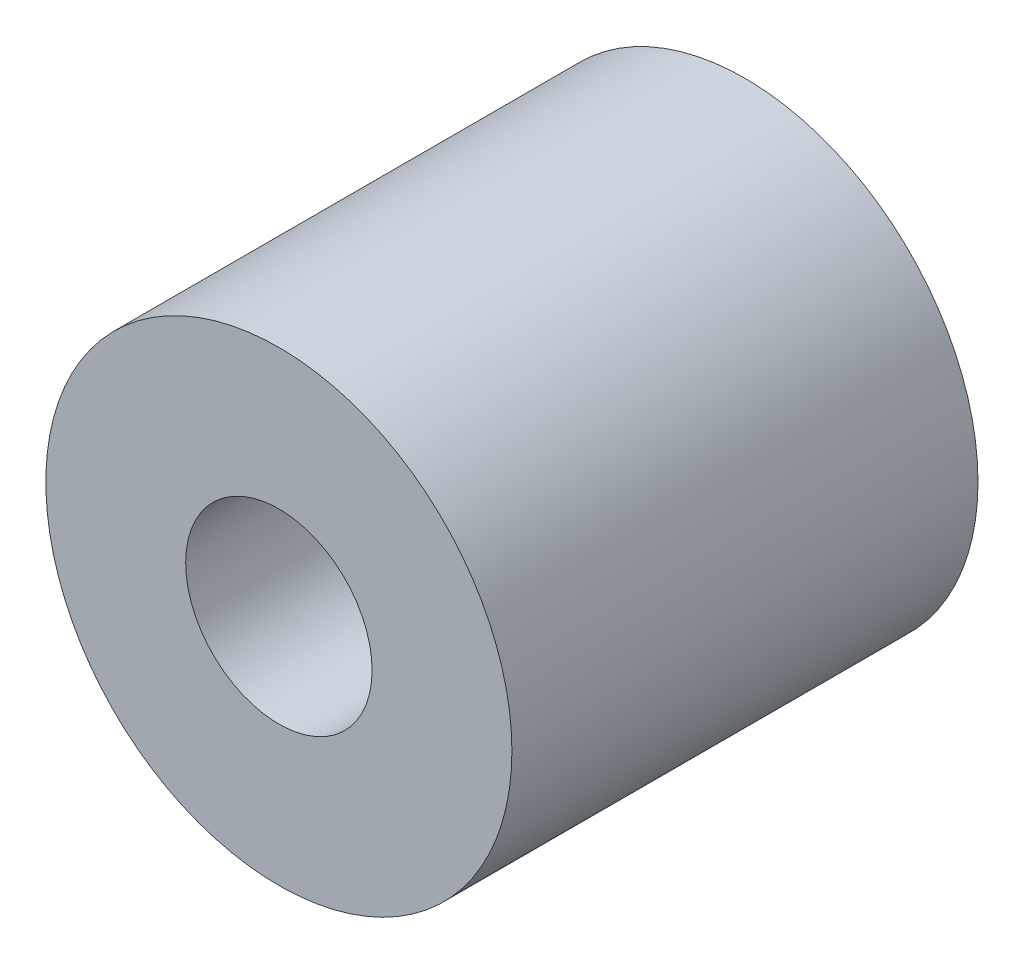
ISO-10303-21;
HEADER;
FILE_DESCRIPTION(('STEP AP214'),'2;1');
FILE_NAME('part.step','',(''),(''),'','','');
FILE_SCHEMA(('AUTOMOTIVE_DESIGN { 1 0 10303 214 1 1 1 1 }'));
ENDSEC;
DATA;
#1=APPLICATION_CONTEXT('core data for automotive mechanical design processes');
#2=APPLICATION_PROTOCOL_DEFINITION('international standard','automotive_design',2000,#1);
#3=PRODUCT_CONTEXT('',#1,'mechanical');
#4=PRODUCT('Part','Part','',(#3));
#5=PRODUCT_RELATED_PRODUCT_CATEGORY('part','',(#4));
#6=PRODUCT_DEFINITION_FORMATION('','',#4);
#7=PRODUCT_DEFINITION_CONTEXT('part definition',#1,'design');
#8=PRODUCT_DEFINITION('design','',#6,#7);
#9=PRODUCT_DEFINITION_SHAPE('','',#8);
#10=(LENGTH_UNIT() NAMED_UNIT(*) SI_UNIT(.MILLI.,.METRE.));
#11=(NAMED_UNIT(*) PLANE_ANGLE_UNIT() SI_UNIT($,.RADIAN.));
#12=(NAMED_UNIT(*) SI_UNIT($,.STERADIAN.) SOLID_ANGLE_UNIT());
#13=UNCERTAINTY_MEASURE_WITH_UNIT(LENGTH_MEASURE(1.E-05),#10,'distance_accuracy_value','');
#14=(GEOMETRIC_REPRESENTATION_CONTEXT(3) GLOBAL_UNCERTAINTY_ASSIGNED_CONTEXT((#13)) GLOBAL_UNIT_ASSIGNED_CONTEXT((#10,
#11,#12)) REPRESENTATION_CONTEXT('',''));
#15=CARTESIAN_POINT('',(0.,0.,0.));
#16=DIRECTION('',(0.,0.,1.));
#17=DIRECTION('',(1.,0.,0.));
#18=AXIS2_PLACEMENT_3D('',#15,#16,#17);
#19=CARTESIAN_POINT('',(0.,0.,25.));
#20=DIRECTION('',(0.,0.,1.));
#21=DIRECTION('',(1.,0.,0.));
#22=AXIS2_PLACEMENT_3D('',#19,#20,#21);
#23=PLANE('',#22);
#24=CARTESIAN_POINT('',(0.,0.,25.));
#25=DIRECTION('',(0.,0.,1.));
#26=DIRECTION('',(1.,0.,0.));
#27=AXIS2_PLACEMENT_3D('',#24,#25,#26);
#28=CIRCLE('',#27,12.5);
#29=CARTESIAN_POINT('',(12.5,0.,25.));
#30=VERTEX_POINT('',#29);
#31=EDGE_CURVE('E10',#30,#30,#28,.T.);
#32=ORIENTED_EDGE('',*,*,#31,.T.);
#33=EDGE_LOOP('',(#32));
#34=FACE_BOUND('',#33,.T.);
#35=CARTESIAN_POINT('',(0.,0.,25.));
#36=DIRECTION('',(0.,0.,1.));
#37=DIRECTION('',(1.,0.,0.));
#38=AXIS2_PLACEMENT_3D('',#35,#36,#37);
#39=CIRCLE('',#38,5.);
#40=CARTESIAN_POINT('',(5.,0.,25.));
#41=VERTEX_POINT('',#40);
#42=EDGE_CURVE('E50',#41,#41,#39,.T.);
#43=ORIENTED_EDGE('',*,*,#42,.F.);
#44=EDGE_LOOP('',(#43));
#45=FACE_BOUND('',#44,.T.);
#46=ADVANCED_FACE('F37',(#34,#45),#23,.T.);
#47=CARTESIAN_POINT('',(0.,0.,0.));
#48=DIRECTION('',(0.,0.,1.));
#49=DIRECTION('',(1.,0.,0.));
#50=AXIS2_PLACEMENT_3D('',#47,#48,#49);
#51=PLANE('',#50);
#52=CARTESIAN_POINT('',(0.,0.,0.));
#53=DIRECTION('',(0.,0.,1.));
#54=DIRECTION('',(1.,0.,0.));
#55=AXIS2_PLACEMENT_3D('',#52,#53,#54);
#56=CIRCLE('',#55,12.5);
#57=CARTESIAN_POINT('',(12.5,0.,0.));
#58=VERTEX_POINT('',#57);
#59=EDGE_CURVE('E41',#58,#58,#56,.T.);
#60=ORIENTED_EDGE('',*,*,#59,.F.);
#61=EDGE_LOOP('',(#60));
#62=FACE_BOUND('',#61,.T.);
#63=CARTESIAN_POINT('',(0.,0.,0.));
#64=DIRECTION('',(0.,0.,1.));
#65=DIRECTION('',(1.,0.,0.));
#66=AXIS2_PLACEMENT_3D('',#63,#64,#65);
#67=CIRCLE('',#66,5.);
#68=CARTESIAN_POINT('',(5.,0.,0.));
#69=VERTEX_POINT('',#68);
#70=EDGE_CURVE('E52',#69,#69,#67,.T.);
#71=ORIENTED_EDGE('',*,*,#70,.T.);
#72=EDGE_LOOP('',(#71));
#73=FACE_BOUND('',#72,.T.);
#74=ADVANCED_FACE('F64',(#62,#73),#51,.F.);
#75=CARTESIAN_POINT('',(0.,0.,25.));
#76=DIRECTION('',(0.,0.,-1.));
#77=DIRECTION('',(-1.,0.,0.));
#78=AXIS2_PLACEMENT_3D('',#75,#76,#77);
#79=CYLINDRICAL_SURFACE('',#78,12.5);
#80=ORIENTED_EDGE('',*,*,#31,.F.);
#81=EDGE_LOOP('',(#80));
#82=FACE_BOUND('',#81,.T.);
#83=ORIENTED_EDGE('',*,*,#59,.T.);
#84=EDGE_LOOP('',(#83));
#85=FACE_BOUND('',#84,.T.);
#86=ADVANCED_FACE('F39',(#82,#85),#79,.T.);
#87=CARTESIAN_POINT('',(0.,0.,25.));
#88=DIRECTION('',(0.,0.,-1.));
#89=DIRECTION('',(-1.,0.,0.));
#90=AXIS2_PLACEMENT_3D('',#87,#88,#89);
#91=CYLINDRICAL_SURFACE('',#90,5.);
#92=ORIENTED_EDGE('',*,*,#42,.T.);
#93=EDGE_LOOP('',(#92));
#94=FACE_BOUND('',#93,.T.);
#95=ORIENTED_EDGE('',*,*,#70,.F.);
#96=EDGE_LOOP('',(#95));
#97=FACE_BOUND('',#96,.T.);
#98=ADVANCED_FACE('F60',(#94,#97),#91,.F.);
#99=CLOSED_SHELL('',(#46,#74,#86,#98));
#100=MANIFOLD_SOLID_BREP('B2',#99);
#101=ADVANCED_BREP_SHAPE_REPRESENTATION('',(#18,#100),#14);
#102=SHAPE_DEFINITION_REPRESENTATION(#9,#101);
ENDSEC;
END-ISO-10303-21;
